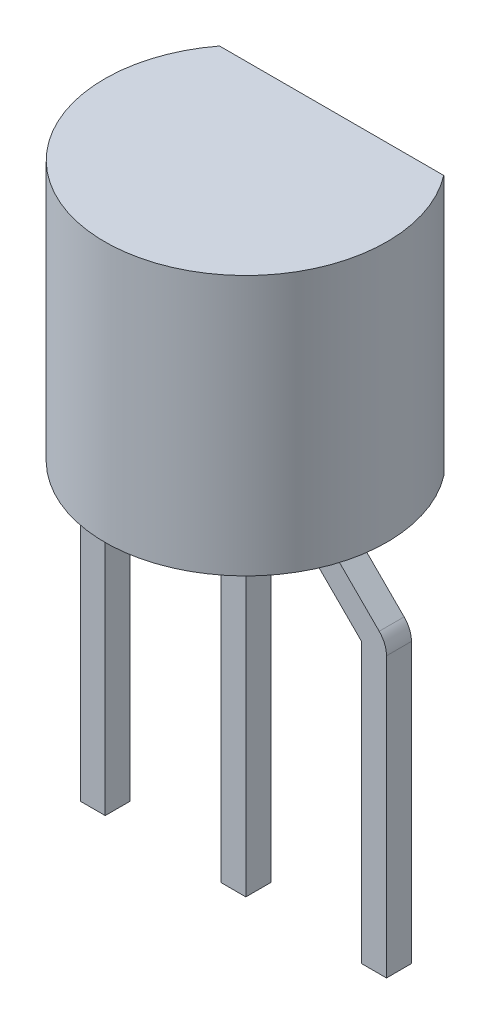
ISO-10303-21;
HEADER;
FILE_DESCRIPTION(('STEP AP214'),'2;1');
FILE_NAME('part.step','',(''),(''),'','','');
FILE_SCHEMA(('AUTOMOTIVE_DESIGN { 1 0 10303 214 1 1 1 1 }'));
ENDSEC;
DATA;
#1=APPLICATION_CONTEXT('core data for automotive mechanical design processes');
#2=APPLICATION_PROTOCOL_DEFINITION('international standard','automotive_design',2000,#1);
#3=PRODUCT_CONTEXT('',#1,'mechanical');
#4=PRODUCT('Part','Part','',(#3));
#5=PRODUCT_RELATED_PRODUCT_CATEGORY('part','',(#4));
#6=PRODUCT_DEFINITION_FORMATION('','',#4);
#7=PRODUCT_DEFINITION_CONTEXT('part definition',#1,'design');
#8=PRODUCT_DEFINITION('design','',#6,#7);
#9=PRODUCT_DEFINITION_SHAPE('','',#8);
#10=(LENGTH_UNIT() NAMED_UNIT(*) SI_UNIT(.MILLI.,.METRE.));
#11=(NAMED_UNIT(*) PLANE_ANGLE_UNIT() SI_UNIT($,.RADIAN.));
#12=(NAMED_UNIT(*) SI_UNIT($,.STERADIAN.) SOLID_ANGLE_UNIT());
#13=UNCERTAINTY_MEASURE_WITH_UNIT(LENGTH_MEASURE(1.E-05),#10,'distance_accuracy_value','');
#14=(GEOMETRIC_REPRESENTATION_CONTEXT(3) GLOBAL_UNCERTAINTY_ASSIGNED_CONTEXT((#13)) GLOBAL_UNIT_ASSIGNED_CONTEXT((#10,
#11,#12)) REPRESENTATION_CONTEXT('',''));
#15=CARTESIAN_POINT('',(0.,0.,0.));
#16=DIRECTION('',(0.,0.,1.));
#17=DIRECTION('',(1.,0.,0.));
#18=AXIS2_PLACEMENT_3D('',#15,#16,#17);
#19=CARTESIAN_POINT('',(-1.495,-0.1,0.225));
#20=DIRECTION('',(0.,0.,-1.));
#21=DIRECTION('',(-1.,0.,0.));
#22=AXIS2_PLACEMENT_3D('',#19,#20,#21);
#23=PLANE('',#22);
#24=DIRECTION('',(0.,1.,0.));
#25=VECTOR('',#24,1.);
#26=CARTESIAN_POINT('',(-1.495,-0.1,0.225));
#27=LINE('',#26,#25);
#28=CARTESIAN_POINT('',(-1.495,-0.1,0.225));
#29=VERTEX_POINT('',#28);
#30=CARTESIAN_POINT('',(-1.495,0.,0.225));
#31=VERTEX_POINT('',#30);
#32=EDGE_CURVE('E126',#29,#31,#27,.T.);
#33=ORIENTED_EDGE('',*,*,#32,.F.);
#34=DIRECTION('',(0.707106781186549,0.707106781186546,0.));
#35=VECTOR('',#34,1.);
#36=CARTESIAN_POINT('',(-2.63344191771034,-1.23844191771034,0.225));
#37=LINE('',#36,#35);
#38=CARTESIAN_POINT('',(-2.63344191771034,-1.23844191771034,0.225));
#39=VERTEX_POINT('',#38);
#40=EDGE_CURVE('E209',#29,#39,#37,.F.);
#41=ORIENTED_EDGE('',*,*,#40,.T.);
#42=CARTESIAN_POINT('',(-2.3152438661764,-1.55663996924429,0.225));
#43=DIRECTION('',(0.,0.,-1.));
#44=DIRECTION('',(-1.,0.,0.));
#45=AXIS2_PLACEMENT_3D('',#42,#43,#44);
#46=CIRCLE('',#45,0.45);
#47=CARTESIAN_POINT('',(-2.7652438661764,-1.55663996924429,0.225));
#48=VERTEX_POINT('',#47);
#49=EDGE_CURVE('E207',#48,#39,#46,.T.);
#50=ORIENTED_EDGE('',*,*,#49,.F.);
#51=DIRECTION('',(0.,1.,0.));
#52=VECTOR('',#51,1.);
#53=CARTESIAN_POINT('',(-2.7652438661764,-6.59663996924429,0.225));
#54=LINE('',#53,#52);
#55=CARTESIAN_POINT('',(-2.7652438661764,-6.59663996924429,0.225));
#56=VERTEX_POINT('',#55);
#57=EDGE_CURVE('E151',#48,#56,#54,.F.);
#58=ORIENTED_EDGE('',*,*,#57,.T.);
#59=DIRECTION('',(1.,0.,0.));
#60=VECTOR('',#59,1.);
#61=CARTESIAN_POINT('',(-2.7652438661764,-6.59663996924429,0.225));
#62=LINE('',#61,#60);
#63=CARTESIAN_POINT('',(-2.3152438661764,-6.59663996924429,0.225));
#64=VERTEX_POINT('',#63);
#65=EDGE_CURVE('E144',#64,#56,#62,.F.);
#66=ORIENTED_EDGE('',*,*,#65,.F.);
#67=DIRECTION('',(0.,-1.,0.));
#68=VECTOR('',#67,1.);
#69=CARTESIAN_POINT('',(-2.3152438661764,-6.59663996924429,0.225));
#70=LINE('',#69,#68);
#71=CARTESIAN_POINT('',(-2.3152438661764,-1.55663996924429,0.225));
#72=VERTEX_POINT('',#71);
#73=EDGE_CURVE('E246',#64,#72,#70,.F.);
#74=ORIENTED_EDGE('',*,*,#73,.T.);
#75=DIRECTION('',(-0.707106781186549,-0.707106781186546,0.));
#76=VECTOR('',#75,1.);
#77=CARTESIAN_POINT('',(-1.17680194846605,-0.418198051533947,0.225));
#78=LINE('',#77,#76);
#79=CARTESIAN_POINT('',(-1.17680194846605,-0.418198051533947,0.225));
#80=VERTEX_POINT('',#79);
#81=EDGE_CURVE('E137',#80,#72,#78,.T.);
#82=ORIENTED_EDGE('',*,*,#81,.F.);
#83=CARTESIAN_POINT('',(-1.495,-0.1,0.225));
#84=DIRECTION('',(0.,0.,1.));
#85=DIRECTION('',(1.,0.,0.));
#86=AXIS2_PLACEMENT_3D('',#83,#84,#85);
#87=CIRCLE('',#86,0.45);
#88=CARTESIAN_POINT('',(-1.045,-0.1,0.225));
#89=VERTEX_POINT('',#88);
#90=EDGE_CURVE('E18',#89,#80,#87,.F.);
#91=ORIENTED_EDGE('',*,*,#90,.F.);
#92=DIRECTION('',(0.,1.,0.));
#93=VECTOR('',#92,1.);
#94=CARTESIAN_POINT('',(-1.045,-0.1,0.225));
#95=LINE('',#94,#93);
#96=CARTESIAN_POINT('',(-1.045,0.,0.225));
#97=VERTEX_POINT('',#96);
#98=EDGE_CURVE('E107',#97,#89,#95,.F.);
#99=ORIENTED_EDGE('',*,*,#98,.F.);
#100=DIRECTION('',(-1.,0.,0.));
#101=VECTOR('',#100,1.);
#102=CARTESIAN_POINT('',(-1.495,0.,0.225));
#103=LINE('',#102,#101);
#104=EDGE_CURVE('E116',#31,#97,#103,.F.);
#105=ORIENTED_EDGE('',*,*,#104,.F.);
#106=EDGE_LOOP('',(#33,#41,#50,#58,#66,#74,#82,#91,#99,#105));
#107=FACE_BOUND('',#106,.T.);
#108=ADVANCED_FACE('F15',(#107),#23,.F.);
#109=CARTESIAN_POINT('',(1.045,-0.1,0.225));
#110=DIRECTION('',(0.,0.,-1.));
#111=DIRECTION('',(-1.,0.,0.));
#112=AXIS2_PLACEMENT_3D('',#109,#110,#111);
#113=PLANE('',#112);
#114=DIRECTION('',(0.,1.,0.));
#115=VECTOR('',#114,1.);
#116=CARTESIAN_POINT('',(1.045,-0.1,0.225));
#117=LINE('',#116,#115);
#118=CARTESIAN_POINT('',(1.045,-0.1,0.225));
#119=VERTEX_POINT('',#118);
#120=CARTESIAN_POINT('',(1.045,0.,0.225));
#121=VERTEX_POINT('',#120);
#122=EDGE_CURVE('E166',#119,#121,#117,.T.);
#123=ORIENTED_EDGE('',*,*,#122,.F.);
#124=CARTESIAN_POINT('',(1.495,-0.1,0.225));
#125=DIRECTION('',(0.,0.,-1.));
#126=DIRECTION('',(-1.,0.,0.));
#127=AXIS2_PLACEMENT_3D('',#124,#125,#126);
#128=CIRCLE('',#127,0.45);
#129=CARTESIAN_POINT('',(1.17680194846605,-0.418198051533947,0.225));
#130=VERTEX_POINT('',#129);
#131=EDGE_CURVE('E202',#130,#119,#128,.T.);
#132=ORIENTED_EDGE('',*,*,#131,.F.);
#133=DIRECTION('',(-0.707106781186549,0.707106781186546,0.));
#134=VECTOR('',#133,1.);
#135=CARTESIAN_POINT('',(2.3152438661764,-1.55663996924429,0.225));
#136=LINE('',#135,#134);
#137=CARTESIAN_POINT('',(2.3152438661764,-1.55663996924429,0.225));
#138=VERTEX_POINT('',#137);
#139=EDGE_CURVE('E205',#130,#138,#136,.F.);
#140=ORIENTED_EDGE('',*,*,#139,.T.);
#141=DIRECTION('',(0.,1.,0.));
#142=VECTOR('',#141,1.);
#143=CARTESIAN_POINT('',(2.3152438661764,-6.59663996924429,0.225));
#144=LINE('',#143,#142);
#145=CARTESIAN_POINT('',(2.3152438661764,-6.59663996924429,0.225));
#146=VERTEX_POINT('',#145);
#147=EDGE_CURVE('E235',#138,#146,#144,.F.);
#148=ORIENTED_EDGE('',*,*,#147,.T.);
#149=DIRECTION('',(1.,0.,0.));
#150=VECTOR('',#149,1.);
#151=CARTESIAN_POINT('',(2.3152438661764,-6.59663996924429,0.225));
#152=LINE('',#151,#150);
#153=CARTESIAN_POINT('',(2.7652438661764,-6.59663996924429,0.225));
#154=VERTEX_POINT('',#153);
#155=EDGE_CURVE('E228',#154,#146,#152,.F.);
#156=ORIENTED_EDGE('',*,*,#155,.F.);
#157=DIRECTION('',(0.,-1.,0.));
#158=VECTOR('',#157,1.);
#159=CARTESIAN_POINT('',(2.7652438661764,-6.59663996924429,0.225));
#160=LINE('',#159,#158);
#161=CARTESIAN_POINT('',(2.7652438661764,-1.55663996924429,0.225));
#162=VERTEX_POINT('',#161);
#163=EDGE_CURVE('E314',#154,#162,#160,.F.);
#164=ORIENTED_EDGE('',*,*,#163,.T.);
#165=CARTESIAN_POINT('',(2.3152438661764,-1.55663996924429,0.225));
#166=DIRECTION('',(0.,0.,1.));
#167=DIRECTION('',(1.,0.,0.));
#168=AXIS2_PLACEMENT_3D('',#165,#166,#167);
#169=CIRCLE('',#168,0.45);
#170=CARTESIAN_POINT('',(2.63344191771034,-1.23844191771034,0.225));
#171=VERTEX_POINT('',#170);
#172=EDGE_CURVE('E210',#171,#162,#169,.F.);
#173=ORIENTED_EDGE('',*,*,#172,.F.);
#174=DIRECTION('',(0.707106781186549,-0.707106781186546,0.));
#175=VECTOR('',#174,1.);
#176=CARTESIAN_POINT('',(1.495,-0.1,0.225));
#177=LINE('',#176,#175);
#178=CARTESIAN_POINT('',(1.495,-0.1,0.225));
#179=VERTEX_POINT('',#178);
#180=EDGE_CURVE('E171',#179,#171,#177,.T.);
#181=ORIENTED_EDGE('',*,*,#180,.F.);
#182=DIRECTION('',(0.,1.,0.));
#183=VECTOR('',#182,1.);
#184=CARTESIAN_POINT('',(1.495,-0.1,0.225));
#185=LINE('',#184,#183);
#186=CARTESIAN_POINT('',(1.495,0.,0.225));
#187=VERTEX_POINT('',#186);
#188=EDGE_CURVE('E125',#187,#179,#185,.F.);
#189=ORIENTED_EDGE('',*,*,#188,.F.);
#190=DIRECTION('',(-1.,0.,0.));
#191=VECTOR('',#190,1.);
#192=CARTESIAN_POINT('',(1.045,0.,0.225));
#193=LINE('',#192,#191);
#194=EDGE_CURVE('E162',#121,#187,#193,.F.);
#195=ORIENTED_EDGE('',*,*,#194,.F.);
#196=EDGE_LOOP('',(#123,#132,#140,#148,#156,#164,#173,#181,#189,#195));
#197=FACE_BOUND('',#196,.T.);
#198=ADVANCED_FACE('F526',(#197),#113,.F.);
#199=CARTESIAN_POINT('',(-0.225,-1.59863016228097,0.225));
#200=DIRECTION('',(1.,0.,0.));
#201=DIRECTION('',(0.,0.,-1.));
#202=AXIS2_PLACEMENT_3D('',#199,#200,#201);
#203=PLANE('',#202);
#204=DIRECTION('',(0.,1.,0.));
#205=VECTOR('',#204,1.);
#206=CARTESIAN_POINT('',(-0.225,-1.59863016228097,-0.225));
#207=LINE('',#206,#205);
#208=CARTESIAN_POINT('',(-0.225,0.,-0.225));
#209=VERTEX_POINT('',#208);
#210=CARTESIAN_POINT('',(-0.225,-6.59863016228097,-0.225));
#211=VERTEX_POINT('',#210);
#212=EDGE_CURVE('E452',#209,#211,#207,.F.);
#213=ORIENTED_EDGE('',*,*,#212,.T.);
#214=DIRECTION('',(0.,0.,-1.));
#215=VECTOR('',#214,1.);
#216=CARTESIAN_POINT('',(-0.225,-6.59863016228097,-0.225));
#217=LINE('',#216,#215);
#218=CARTESIAN_POINT('',(-0.225,-6.59863016228097,0.225));
#219=VERTEX_POINT('',#218);
#220=EDGE_CURVE('E454',#219,#211,#217,.T.);
#221=ORIENTED_EDGE('',*,*,#220,.F.);
#222=DIRECTION('',(0.,1.,0.));
#223=VECTOR('',#222,1.);
#224=CARTESIAN_POINT('',(-0.225,-1.59863016228097,0.225));
#225=LINE('',#224,#223);
#226=CARTESIAN_POINT('',(-0.225,0.,0.225));
#227=VERTEX_POINT('',#226);
#228=EDGE_CURVE('E501',#219,#227,#225,.T.);
#229=ORIENTED_EDGE('',*,*,#228,.T.);
#230=DIRECTION('',(0.,0.,-1.));
#231=VECTOR('',#230,1.);
#232=CARTESIAN_POINT('',(-0.225,0.,0.225));
#233=LINE('',#232,#231);
#234=EDGE_CURVE('E165',#209,#227,#233,.F.);
#235=ORIENTED_EDGE('',*,*,#234,.F.);
#236=EDGE_LOOP('',(#213,#221,#229,#235));
#237=FACE_BOUND('',#236,.T.);
#238=ADVANCED_FACE('F792',(#237),#203,.F.);
#239=CARTESIAN_POINT('',(-2.63344191771034,-1.23844191771034,-0.225));
#240=DIRECTION('',(0.707106781186546,-0.707106781186549,0.));
#241=DIRECTION('',(0.707106781186549,0.707106781186546,0.));
#242=AXIS2_PLACEMENT_3D('',#239,#240,#241);
#243=PLANE('',#242);
#244=DIRECTION('',(-0.707106781186549,-0.707106781186546,0.));
#245=VECTOR('',#244,1.);
#246=CARTESIAN_POINT('',(-1.495,-0.1,-0.225));
#247=LINE('',#246,#245);
#248=CARTESIAN_POINT('',(-1.495,-0.1,-0.225));
#249=VERTEX_POINT('',#248);
#250=CARTESIAN_POINT('',(-2.63344191771034,-1.23844191771034,-0.225));
#251=VERTEX_POINT('',#250);
#252=EDGE_CURVE('E201',#249,#251,#247,.T.);
#253=ORIENTED_EDGE('',*,*,#252,.T.);
#254=DIRECTION('',(0.,0.,-1.));
#255=VECTOR('',#254,1.);
#256=CARTESIAN_POINT('',(-2.63344191771034,-1.23844191771034,-0.225));
#257=LINE('',#256,#255);
#258=EDGE_CURVE('E155',#39,#251,#257,.T.);
#259=ORIENTED_EDGE('',*,*,#258,.F.);
#260=ORIENTED_EDGE('',*,*,#40,.F.);
#261=DIRECTION('',(0.,0.,-1.));
#262=VECTOR('',#261,1.);
#263=CARTESIAN_POINT('',(-1.495,-0.1,0.225));
#264=LINE('',#263,#262);
#265=EDGE_CURVE('E297',#29,#249,#264,.T.);
#266=ORIENTED_EDGE('',*,*,#265,.T.);
#267=EDGE_LOOP('',(#253,#259,#260,#266));
#268=FACE_BOUND('',#267,.T.);
#269=ADVANCED_FACE('F783',(#268),#243,.F.);
#270=CARTESIAN_POINT('',(-2.3152438661764,-1.55663996924429,-0.225));
#271=DIRECTION('',(0.,0.,-1.));
#272=DIRECTION('',(-1.,0.,0.));
#273=AXIS2_PLACEMENT_3D('',#270,#271,#272);
#274=CYLINDRICAL_SURFACE('',#273,0.45);
#275=ORIENTED_EDGE('',*,*,#258,.T.);
#276=CARTESIAN_POINT('',(-2.3152438661764,-1.55663996924429,-0.225));
#277=DIRECTION('',(0.,0.,-1.));
#278=DIRECTION('',(-1.,0.,0.));
#279=AXIS2_PLACEMENT_3D('',#276,#277,#278);
#280=CIRCLE('',#279,0.45);
#281=CARTESIAN_POINT('',(-2.7652438661764,-1.55663996924429,-0.225));
#282=VERTEX_POINT('',#281);
#283=EDGE_CURVE('E198',#251,#282,#280,.F.);
#284=ORIENTED_EDGE('',*,*,#283,.T.);
#285=DIRECTION('',(0.,0.,1.));
#286=VECTOR('',#285,1.);
#287=CARTESIAN_POINT('',(-2.7652438661764,-1.55663996924429,0.225));
#288=LINE('',#287,#286);
#289=EDGE_CURVE('E154',#282,#48,#288,.T.);
#290=ORIENTED_EDGE('',*,*,#289,.T.);
#291=ORIENTED_EDGE('',*,*,#49,.T.);
#292=EDGE_LOOP('',(#275,#284,#290,#291));
#293=FACE_BOUND('',#292,.T.);
#294=ADVANCED_FACE('F774',(#293),#274,.T.);
#295=CARTESIAN_POINT('',(-2.7652438661764,-6.59663996924429,0.225));
#296=DIRECTION('',(1.,0.,0.));
#297=DIRECTION('',(0.,1.,0.));
#298=AXIS2_PLACEMENT_3D('',#295,#296,#297);
#299=PLANE('',#298);
#300=DIRECTION('',(0.,1.,0.));
#301=VECTOR('',#300,1.);
#302=CARTESIAN_POINT('',(-2.7652438661764,-0.1,-0.225));
#303=LINE('',#302,#301);
#304=CARTESIAN_POINT('',(-2.7652438661764,-6.59663996924429,-0.225));
#305=VERTEX_POINT('',#304);
#306=EDGE_CURVE('E200',#282,#305,#303,.F.);
#307=ORIENTED_EDGE('',*,*,#306,.T.);
#308=DIRECTION('',(0.,0.,1.));
#309=VECTOR('',#308,1.);
#310=CARTESIAN_POINT('',(-2.7652438661764,-6.59663996924429,-0.225));
#311=LINE('',#310,#309);
#312=EDGE_CURVE('E148',#56,#305,#311,.F.);
#313=ORIENTED_EDGE('',*,*,#312,.F.);
#314=ORIENTED_EDGE('',*,*,#57,.F.);
#315=ORIENTED_EDGE('',*,*,#289,.F.);
#316=EDGE_LOOP('',(#307,#313,#314,#315));
#317=FACE_BOUND('',#316,.T.);
#318=ADVANCED_FACE('F765',(#317),#299,.F.);
#319=CARTESIAN_POINT('',(-2.7652438661764,-6.59663996924429,-0.225));
#320=DIRECTION('',(0.,-1.,0.));
#321=DIRECTION('',(1.,0.,0.));
#322=AXIS2_PLACEMENT_3D('',#319,#320,#321);
#323=PLANE('',#322);
#324=DIRECTION('',(0.,0.,1.));
#325=VECTOR('',#324,1.);
#326=CARTESIAN_POINT('',(-2.3152438661764,-6.59663996924429,0.225));
#327=LINE('',#326,#325);
#328=CARTESIAN_POINT('',(-2.3152438661764,-6.59663996924429,-0.225));
#329=VERTEX_POINT('',#328);
#330=EDGE_CURVE('E147',#329,#64,#327,.T.);
#331=ORIENTED_EDGE('',*,*,#330,.T.);
#332=ORIENTED_EDGE('',*,*,#65,.T.);
#333=ORIENTED_EDGE('',*,*,#312,.T.);
#334=DIRECTION('',(1.,0.,0.));
#335=VECTOR('',#334,1.);
#336=CARTESIAN_POINT('',(-1.495,-6.59663996924429,-0.225));
#337=LINE('',#336,#335);
#338=EDGE_CURVE('E276',#305,#329,#337,.T.);
#339=ORIENTED_EDGE('',*,*,#338,.T.);
#340=EDGE_LOOP('',(#331,#332,#333,#339));
#341=FACE_BOUND('',#340,.T.);
#342=ADVANCED_FACE('F757',(#341),#323,.T.);
#343=CARTESIAN_POINT('',(-2.3152438661764,-6.59663996924429,0.225));
#344=DIRECTION('',(-1.,0.,0.));
#345=DIRECTION('',(0.,-1.,0.));
#346=AXIS2_PLACEMENT_3D('',#343,#344,#345);
#347=PLANE('',#346);
#348=ORIENTED_EDGE('',*,*,#73,.F.);
#349=ORIENTED_EDGE('',*,*,#330,.F.);
#350=DIRECTION('',(0.,1.,0.));
#351=VECTOR('',#350,1.);
#352=CARTESIAN_POINT('',(-2.3152438661764,-0.1,-0.225));
#353=LINE('',#352,#351);
#354=CARTESIAN_POINT('',(-2.3152438661764,-1.55663996924429,-0.225));
#355=VERTEX_POINT('',#354);
#356=EDGE_CURVE('E268',#329,#355,#353,.T.);
#357=ORIENTED_EDGE('',*,*,#356,.T.);
#358=DIRECTION('',(0.,0.,1.));
#359=VECTOR('',#358,1.);
#360=CARTESIAN_POINT('',(-2.3152438661764,-1.55663996924429,-0.225));
#361=LINE('',#360,#359);
#362=EDGE_CURVE('E249',#355,#72,#361,.T.);
#363=ORIENTED_EDGE('',*,*,#362,.T.);
#364=EDGE_LOOP('',(#348,#349,#357,#363));
#365=FACE_BOUND('',#364,.T.);
#366=ADVANCED_FACE('F266',(#365),#347,.F.);
#367=CARTESIAN_POINT('',(-2.3152438661764,-1.55663996924429,-0.225));
#368=DIRECTION('',(-0.707106781186546,0.707106781186549,0.));
#369=DIRECTION('',(-0.707106781186549,-0.707106781186546,0.));
#370=AXIS2_PLACEMENT_3D('',#367,#368,#369);
#371=PLANE('',#370);
#372=ORIENTED_EDGE('',*,*,#81,.T.);
#373=ORIENTED_EDGE('',*,*,#362,.F.);
#374=DIRECTION('',(0.707106781186549,0.707106781186546,0.));
#375=VECTOR('',#374,1.);
#376=CARTESIAN_POINT('',(-2.3152438661764,-1.55663996924429,-0.225));
#377=LINE('',#376,#375);
#378=CARTESIAN_POINT('',(-1.17680194846605,-0.418198051533947,-0.225));
#379=VERTEX_POINT('',#378);
#380=EDGE_CURVE('E197',#355,#379,#377,.T.);
#381=ORIENTED_EDGE('',*,*,#380,.T.);
#382=DIRECTION('',(0.,0.,1.));
#383=VECTOR('',#382,1.);
#384=CARTESIAN_POINT('',(-1.17680194846605,-0.418198051533947,0.225));
#385=LINE('',#384,#383);
#386=EDGE_CURVE('E206',#80,#379,#385,.F.);
#387=ORIENTED_EDGE('',*,*,#386,.F.);
#388=EDGE_LOOP('',(#372,#373,#381,#387));
#389=FACE_BOUND('',#388,.T.);
#390=ADVANCED_FACE('F255',(#389),#371,.F.);
#391=CARTESIAN_POINT('',(-1.495,-0.1,0.225));
#392=DIRECTION('',(0.,0.,1.));
#393=DIRECTION('',(1.,0.,0.));
#394=AXIS2_PLACEMENT_3D('',#391,#392,#393);
#395=CYLINDRICAL_SURFACE('',#394,0.45);
#396=CARTESIAN_POINT('',(-1.495,-0.1,-0.225));
#397=DIRECTION('',(0.,0.,1.));
#398=DIRECTION('',(1.,0.,0.));
#399=AXIS2_PLACEMENT_3D('',#396,#397,#398);
#400=CIRCLE('',#399,0.45);
#401=CARTESIAN_POINT('',(-1.045,-0.1,-0.225));
#402=VERTEX_POINT('',#401);
#403=EDGE_CURVE('E195',#379,#402,#400,.T.);
#404=ORIENTED_EDGE('',*,*,#403,.T.);
#405=DIRECTION('',(0.,0.,1.));
#406=VECTOR('',#405,1.);
#407=CARTESIAN_POINT('',(-1.045,-0.1,0.225));
#408=LINE('',#407,#406);
#409=EDGE_CURVE('E354',#402,#89,#408,.T.);
#410=ORIENTED_EDGE('',*,*,#409,.T.);
#411=ORIENTED_EDGE('',*,*,#90,.T.);
#412=ORIENTED_EDGE('',*,*,#386,.T.);
#413=EDGE_LOOP('',(#404,#410,#411,#412));
#414=FACE_BOUND('',#413,.T.);
#415=ADVANCED_FACE('F733',(#414),#395,.T.);
#416=CARTESIAN_POINT('',(1.495,-0.1,0.225));
#417=DIRECTION('',(0.,0.,-1.));
#418=DIRECTION('',(-1.,0.,0.));
#419=AXIS2_PLACEMENT_3D('',#416,#417,#418);
#420=CYLINDRICAL_SURFACE('',#419,0.45);
#421=ORIENTED_EDGE('',*,*,#131,.T.);
#422=DIRECTION('',(0.,0.,-1.));
#423=VECTOR('',#422,1.);
#424=CARTESIAN_POINT('',(1.045,-0.1,0.225));
#425=LINE('',#424,#423);
#426=CARTESIAN_POINT('',(1.045,-0.1,-0.225));
#427=VERTEX_POINT('',#426);
#428=EDGE_CURVE('E352',#119,#427,#425,.T.);
#429=ORIENTED_EDGE('',*,*,#428,.T.);
#430=CARTESIAN_POINT('',(1.495,-0.1,-0.225));
#431=DIRECTION('',(0.,0.,-1.));
#432=DIRECTION('',(-1.,0.,0.));
#433=AXIS2_PLACEMENT_3D('',#430,#431,#432);
#434=CIRCLE('',#433,0.45);
#435=CARTESIAN_POINT('',(1.17680194846605,-0.418198051533947,-0.225));
#436=VERTEX_POINT('',#435);
#437=EDGE_CURVE('E191',#427,#436,#434,.F.);
#438=ORIENTED_EDGE('',*,*,#437,.T.);
#439=DIRECTION('',(0.,0.,1.));
#440=VECTOR('',#439,1.);
#441=CARTESIAN_POINT('',(1.17680194846605,-0.418198051533947,0.225));
#442=LINE('',#441,#440);
#443=EDGE_CURVE('E239',#436,#130,#442,.T.);
#444=ORIENTED_EDGE('',*,*,#443,.T.);
#445=EDGE_LOOP('',(#421,#429,#438,#444));
#446=FACE_BOUND('',#445,.T.);
#447=ADVANCED_FACE('F724',(#446),#420,.T.);
#448=CARTESIAN_POINT('',(2.3152438661764,-1.55663996924429,0.225));
#449=DIRECTION('',(0.707106781186546,0.707106781186549,0.));
#450=DIRECTION('',(-0.707106781186549,0.707106781186546,0.));
#451=AXIS2_PLACEMENT_3D('',#448,#449,#450);
#452=PLANE('',#451);
#453=DIRECTION('',(0.707106781186549,-0.707106781186546,0.));
#454=VECTOR('',#453,1.);
#455=CARTESIAN_POINT('',(1.17680194846605,-0.418198051533947,-0.225));
#456=LINE('',#455,#454);
#457=CARTESIAN_POINT('',(2.3152438661764,-1.55663996924429,-0.225));
#458=VERTEX_POINT('',#457);
#459=EDGE_CURVE('E193',#436,#458,#456,.T.);
#460=ORIENTED_EDGE('',*,*,#459,.T.);
#461=DIRECTION('',(0.,0.,1.));
#462=VECTOR('',#461,1.);
#463=CARTESIAN_POINT('',(2.3152438661764,-1.55663996924429,0.225));
#464=LINE('',#463,#462);
#465=EDGE_CURVE('E238',#458,#138,#464,.T.);
#466=ORIENTED_EDGE('',*,*,#465,.T.);
#467=ORIENTED_EDGE('',*,*,#139,.F.);
#468=ORIENTED_EDGE('',*,*,#443,.F.);
#469=EDGE_LOOP('',(#460,#466,#467,#468));
#470=FACE_BOUND('',#469,.T.);
#471=ADVANCED_FACE('F715',(#470),#452,.F.);
#472=CARTESIAN_POINT('',(2.3152438661764,-6.59663996924429,0.225));
#473=DIRECTION('',(1.,0.,0.));
#474=DIRECTION('',(0.,1.,0.));
#475=AXIS2_PLACEMENT_3D('',#472,#473,#474);
#476=PLANE('',#475);
#477=DIRECTION('',(0.,1.,0.));
#478=VECTOR('',#477,1.);
#479=CARTESIAN_POINT('',(2.3152438661764,-0.1,-0.225));
#480=LINE('',#479,#478);
#481=CARTESIAN_POINT('',(2.3152438661764,-6.59663996924429,-0.225));
#482=VERTEX_POINT('',#481);
#483=EDGE_CURVE('E335',#458,#482,#480,.F.);
#484=ORIENTED_EDGE('',*,*,#483,.T.);
#485=DIRECTION('',(0.,0.,1.));
#486=VECTOR('',#485,1.);
#487=CARTESIAN_POINT('',(2.3152438661764,-6.59663996924429,-0.225000000000001));
#488=LINE('',#487,#486);
#489=EDGE_CURVE('E232',#146,#482,#488,.F.);
#490=ORIENTED_EDGE('',*,*,#489,.F.);
#491=ORIENTED_EDGE('',*,*,#147,.F.);
#492=ORIENTED_EDGE('',*,*,#465,.F.);
#493=EDGE_LOOP('',(#484,#490,#491,#492));
#494=FACE_BOUND('',#493,.T.);
#495=ADVANCED_FACE('F543',(#494),#476,.F.);
#496=CARTESIAN_POINT('',(2.3152438661764,-6.59663996924429,-0.225000000000001));
#497=DIRECTION('',(0.,-1.,0.));
#498=DIRECTION('',(1.,0.,0.));
#499=AXIS2_PLACEMENT_3D('',#496,#497,#498);
#500=PLANE('',#499);
#501=DIRECTION('',(0.,0.,1.));
#502=VECTOR('',#501,1.);
#503=CARTESIAN_POINT('',(2.7652438661764,-6.59663996924429,0.225));
#504=LINE('',#503,#502);
#505=CARTESIAN_POINT('',(2.7652438661764,-6.59663996924429,-0.225));
#506=VERTEX_POINT('',#505);
#507=EDGE_CURVE('E231',#506,#154,#504,.T.);
#508=ORIENTED_EDGE('',*,*,#507,.T.);
#509=ORIENTED_EDGE('',*,*,#155,.T.);
#510=ORIENTED_EDGE('',*,*,#489,.T.);
#511=DIRECTION('',(1.,0.,0.));
#512=VECTOR('',#511,1.);
#513=CARTESIAN_POINT('',(1.045,-6.59663996924429,-0.225));
#514=LINE('',#513,#512);
#515=EDGE_CURVE('E333',#482,#506,#514,.T.);
#516=ORIENTED_EDGE('',*,*,#515,.T.);
#517=EDGE_LOOP('',(#508,#509,#510,#516));
#518=FACE_BOUND('',#517,.T.);
#519=ADVANCED_FACE('F535',(#518),#500,.T.);
#520=CARTESIAN_POINT('',(2.7652438661764,-6.59663996924429,0.225));
#521=DIRECTION('',(-1.,0.,0.));
#522=DIRECTION('',(0.,-1.,0.));
#523=AXIS2_PLACEMENT_3D('',#520,#521,#522);
#524=PLANE('',#523);
#525=ORIENTED_EDGE('',*,*,#163,.F.);
#526=ORIENTED_EDGE('',*,*,#507,.F.);
#527=DIRECTION('',(0.,1.,0.));
#528=VECTOR('',#527,1.);
#529=CARTESIAN_POINT('',(2.7652438661764,-0.1,-0.225));
#530=LINE('',#529,#528);
#531=CARTESIAN_POINT('',(2.7652438661764,-1.55663996924429,-0.225));
#532=VERTEX_POINT('',#531);
#533=EDGE_CURVE('E190',#506,#532,#530,.T.);
#534=ORIENTED_EDGE('',*,*,#533,.T.);
#535=DIRECTION('',(0.,0.,1.));
#536=VECTOR('',#535,1.);
#537=CARTESIAN_POINT('',(2.7652438661764,-1.55663996924429,0.225));
#538=LINE('',#537,#536);
#539=EDGE_CURVE('E316',#162,#532,#538,.F.);
#540=ORIENTED_EDGE('',*,*,#539,.F.);
#541=EDGE_LOOP('',(#525,#526,#534,#540));
#542=FACE_BOUND('',#541,.T.);
#543=ADVANCED_FACE('F533',(#542),#524,.F.);
#544=CARTESIAN_POINT('',(2.3152438661764,-1.55663996924429,0.225));
#545=DIRECTION('',(0.,0.,1.));
#546=DIRECTION('',(1.,0.,0.));
#547=AXIS2_PLACEMENT_3D('',#544,#545,#546);
#548=CYLINDRICAL_SURFACE('',#547,0.45);
#549=DIRECTION('',(0.,0.,1.));
#550=VECTOR('',#549,1.);
#551=CARTESIAN_POINT('',(2.63344191771034,-1.23844191771034,0.225));
#552=LINE('',#551,#550);
#553=CARTESIAN_POINT('',(2.63344191771034,-1.23844191771034,-0.225));
#554=VERTEX_POINT('',#553);
#555=EDGE_CURVE('E322',#554,#171,#552,.T.);
#556=ORIENTED_EDGE('',*,*,#555,.T.);
#557=ORIENTED_EDGE('',*,*,#172,.T.);
#558=ORIENTED_EDGE('',*,*,#539,.T.);
#559=CARTESIAN_POINT('',(2.3152438661764,-1.55663996924429,-0.225));
#560=DIRECTION('',(0.,0.,1.));
#561=DIRECTION('',(1.,0.,0.));
#562=AXIS2_PLACEMENT_3D('',#559,#560,#561);
#563=CIRCLE('',#562,0.45);
#564=EDGE_CURVE('E187',#532,#554,#563,.T.);
#565=ORIENTED_EDGE('',*,*,#564,.T.);
#566=EDGE_LOOP('',(#556,#557,#558,#565));
#567=FACE_BOUND('',#566,.T.);
#568=ADVANCED_FACE('F528',(#567),#548,.T.);
#569=CARTESIAN_POINT('',(2.63344191771034,-1.23844191771034,0.225));
#570=DIRECTION('',(-0.707106781186546,-0.707106781186549,0.));
#571=DIRECTION('',(0.707106781186549,-0.707106781186546,0.));
#572=AXIS2_PLACEMENT_3D('',#569,#570,#571);
#573=PLANE('',#572);
#574=ORIENTED_EDGE('',*,*,#180,.T.);
#575=ORIENTED_EDGE('',*,*,#555,.F.);
#576=DIRECTION('',(-0.707106781186549,0.707106781186546,0.));
#577=VECTOR('',#576,1.);
#578=CARTESIAN_POINT('',(2.63344191771034,-1.23844191771034,-0.225));
#579=LINE('',#578,#577);
#580=CARTESIAN_POINT('',(1.495,-0.0999999999999999,-0.225));
#581=VERTEX_POINT('',#580);
#582=EDGE_CURVE('E189',#554,#581,#579,.T.);
#583=ORIENTED_EDGE('',*,*,#582,.T.);
#584=DIRECTION('',(0.,0.,1.));
#585=VECTOR('',#584,1.);
#586=CARTESIAN_POINT('',(1.495,-0.1,0.225));
#587=LINE('',#586,#585);
#588=EDGE_CURVE('E511',#179,#581,#587,.F.);
#589=ORIENTED_EDGE('',*,*,#588,.F.);
#590=EDGE_LOOP('',(#574,#575,#583,#589));
#591=FACE_BOUND('',#590,.T.);
#592=ADVANCED_FACE('F527',(#591),#573,.F.);
#593=CARTESIAN_POINT('',(-0.225,-1.59863016228097,-0.225));
#594=DIRECTION('',(0.,0.,1.));
#595=DIRECTION('',(1.,0.,0.));
#596=AXIS2_PLACEMENT_3D('',#593,#594,#595);
#597=PLANE('',#596);
#598=DIRECTION('',(0.,1.,0.));
#599=VECTOR('',#598,1.);
#600=CARTESIAN_POINT('',(0.225,-1.59863016228097,-0.225));
#601=LINE('',#600,#599);
#602=CARTESIAN_POINT('',(0.225,0.,-0.225));
#603=VERTEX_POINT('',#602);
#604=CARTESIAN_POINT('',(0.225,-6.59863016228097,-0.225));
#605=VERTEX_POINT('',#604);
#606=EDGE_CURVE('E450',#603,#605,#601,.F.);
#607=ORIENTED_EDGE('',*,*,#606,.T.);
#608=DIRECTION('',(1.,0.,0.));
#609=VECTOR('',#608,1.);
#610=CARTESIAN_POINT('',(-0.225,-6.59863016228097,-0.225));
#611=LINE('',#610,#609);
#612=EDGE_CURVE('E506',#211,#605,#611,.T.);
#613=ORIENTED_EDGE('',*,*,#612,.F.);
#614=ORIENTED_EDGE('',*,*,#212,.F.);
#615=DIRECTION('',(1.,0.,0.));
#616=VECTOR('',#615,1.);
#617=CARTESIAN_POINT('',(-0.225,0.,-0.225));
#618=LINE('',#617,#616);
#619=EDGE_CURVE('E446',#603,#209,#618,.F.);
#620=ORIENTED_EDGE('',*,*,#619,.F.);
#621=EDGE_LOOP('',(#607,#613,#614,#620));
#622=FACE_BOUND('',#621,.T.);
#623=ADVANCED_FACE('F448',(#622),#597,.F.);
#624=CARTESIAN_POINT('',(-0.225,-6.59863016228097,-0.225));
#625=DIRECTION('',(0.,-1.,0.));
#626=DIRECTION('',(0.,0.,-1.));
#627=AXIS2_PLACEMENT_3D('',#624,#625,#626);
#628=PLANE('',#627);
#629=DIRECTION('',(0.,0.,1.));
#630=VECTOR('',#629,1.);
#631=CARTESIAN_POINT('',(0.225,-6.59863016228097,0.225));
#632=LINE('',#631,#630);
#633=CARTESIAN_POINT('',(0.225,-6.59863016228097,0.225));
#634=VERTEX_POINT('',#633);
#635=EDGE_CURVE('E461',#605,#634,#632,.T.);
#636=ORIENTED_EDGE('',*,*,#635,.T.);
#637=DIRECTION('',(-1.,0.,0.));
#638=VECTOR('',#637,1.);
#639=CARTESIAN_POINT('',(-0.225,-6.59863016228097,0.225));
#640=LINE('',#639,#638);
#641=EDGE_CURVE('E503',#634,#219,#640,.T.);
#642=ORIENTED_EDGE('',*,*,#641,.T.);
#643=ORIENTED_EDGE('',*,*,#220,.T.);
#644=ORIENTED_EDGE('',*,*,#612,.T.);
#645=EDGE_LOOP('',(#636,#642,#643,#644));
#646=FACE_BOUND('',#645,.T.);
#647=ADVANCED_FACE('F580',(#646),#628,.T.);
#648=CARTESIAN_POINT('',(-0.225,-1.59863016228097,0.225));
#649=DIRECTION('',(0.,0.,-1.));
#650=DIRECTION('',(-1.,0.,0.));
#651=AXIS2_PLACEMENT_3D('',#648,#649,#650);
#652=PLANE('',#651);
#653=ORIENTED_EDGE('',*,*,#228,.F.);
#654=ORIENTED_EDGE('',*,*,#641,.F.);
#655=DIRECTION('',(0.,1.,0.));
#656=VECTOR('',#655,1.);
#657=CARTESIAN_POINT('',(0.225,-1.59863016228097,0.225));
#658=LINE('',#657,#656);
#659=CARTESIAN_POINT('',(0.225,0.,0.225));
#660=VERTEX_POINT('',#659);
#661=EDGE_CURVE('E475',#634,#660,#658,.T.);
#662=ORIENTED_EDGE('',*,*,#661,.T.);
#663=DIRECTION('',(-1.,0.,0.));
#664=VECTOR('',#663,1.);
#665=CARTESIAN_POINT('',(-0.225,0.,0.225));
#666=LINE('',#665,#664);
#667=EDGE_CURVE('E302',#227,#660,#666,.F.);
#668=ORIENTED_EDGE('',*,*,#667,.F.);
#669=EDGE_LOOP('',(#653,#654,#662,#668));
#670=FACE_BOUND('',#669,.T.);
#671=ADVANCED_FACE('F577',(#670),#652,.F.);
#672=CARTESIAN_POINT('',(-1.495,-0.1,0.225));
#673=DIRECTION('',(1.,0.,0.));
#674=DIRECTION('',(0.,0.,-1.));
#675=AXIS2_PLACEMENT_3D('',#672,#673,#674);
#676=PLANE('',#675);
#677=DIRECTION('',(0.,1.,0.));
#678=VECTOR('',#677,1.);
#679=CARTESIAN_POINT('',(-1.495,-0.1,-0.225));
#680=LINE('',#679,#678);
#681=CARTESIAN_POINT('',(-1.495,0.,-0.225));
#682=VERTEX_POINT('',#681);
#683=EDGE_CURVE('E294',#682,#249,#680,.F.);
#684=ORIENTED_EDGE('',*,*,#683,.T.);
#685=ORIENTED_EDGE('',*,*,#265,.F.);
#686=ORIENTED_EDGE('',*,*,#32,.T.);
#687=DIRECTION('',(0.,0.,1.));
#688=VECTOR('',#687,1.);
#689=CARTESIAN_POINT('',(-1.495,0.,0.));
#690=LINE('',#689,#688);
#691=EDGE_CURVE('E122',#31,#682,#690,.F.);
#692=ORIENTED_EDGE('',*,*,#691,.T.);
#693=EDGE_LOOP('',(#684,#685,#686,#692));
#694=FACE_BOUND('',#693,.T.);
#695=ADVANCED_FACE('F574',(#694),#676,.F.);
#696=CARTESIAN_POINT('',(-1.495,-0.1,-0.225));
#697=DIRECTION('',(0.,0.,1.));
#698=DIRECTION('',(1.,0.,0.));
#699=AXIS2_PLACEMENT_3D('',#696,#697,#698);
#700=PLANE('',#699);
#701=DIRECTION('',(0.,1.,0.));
#702=VECTOR('',#701,1.);
#703=CARTESIAN_POINT('',(-1.045,-0.1,-0.225));
#704=LINE('',#703,#702);
#705=CARTESIAN_POINT('',(-1.045,0.,-0.225));
#706=VERTEX_POINT('',#705);
#707=EDGE_CURVE('E131',#706,#402,#704,.F.);
#708=ORIENTED_EDGE('',*,*,#707,.T.);
#709=ORIENTED_EDGE('',*,*,#403,.F.);
#710=ORIENTED_EDGE('',*,*,#380,.F.);
#711=ORIENTED_EDGE('',*,*,#356,.F.);
#712=ORIENTED_EDGE('',*,*,#338,.F.);
#713=ORIENTED_EDGE('',*,*,#306,.F.);
#714=ORIENTED_EDGE('',*,*,#283,.F.);
#715=ORIENTED_EDGE('',*,*,#252,.F.);
#716=ORIENTED_EDGE('',*,*,#683,.F.);
#717=DIRECTION('',(1.,0.,0.));
#718=VECTOR('',#717,1.);
#719=CARTESIAN_POINT('',(0.,0.,-0.225));
#720=LINE('',#719,#718);
#721=EDGE_CURVE('E132',#682,#706,#720,.T.);
#722=ORIENTED_EDGE('',*,*,#721,.T.);
#723=EDGE_LOOP('',(#708,#709,#710,#711,#712,#713,#714,#715,#716,#722));
#724=FACE_BOUND('',#723,.T.);
#725=ADVANCED_FACE('F374',(#724),#700,.F.);
#726=CARTESIAN_POINT('',(-1.045,-0.1,0.225));
#727=DIRECTION('',(-1.,0.,0.));
#728=DIRECTION('',(0.,0.,1.));
#729=AXIS2_PLACEMENT_3D('',#726,#727,#728);
#730=PLANE('',#729);
#731=ORIENTED_EDGE('',*,*,#98,.T.);
#732=ORIENTED_EDGE('',*,*,#409,.F.);
#733=ORIENTED_EDGE('',*,*,#707,.F.);
#734=DIRECTION('',(0.,0.,1.));
#735=VECTOR('',#734,1.);
#736=CARTESIAN_POINT('',(-1.045,0.,0.));
#737=LINE('',#736,#735);
#738=EDGE_CURVE('E120',#706,#97,#737,.T.);
#739=ORIENTED_EDGE('',*,*,#738,.T.);
#740=EDGE_LOOP('',(#731,#732,#733,#739));
#741=FACE_BOUND('',#740,.T.);
#742=ADVANCED_FACE('F129',(#741),#730,.F.);
#743=CARTESIAN_POINT('',(1.045,-0.1,0.225));
#744=DIRECTION('',(1.,0.,0.));
#745=DIRECTION('',(0.,0.,-1.));
#746=AXIS2_PLACEMENT_3D('',#743,#744,#745);
#747=PLANE('',#746);
#748=DIRECTION('',(0.,1.,0.));
#749=VECTOR('',#748,1.);
#750=CARTESIAN_POINT('',(1.045,-0.1,-0.225));
#751=LINE('',#750,#749);
#752=CARTESIAN_POINT('',(1.045,0.,-0.225));
#753=VERTEX_POINT('',#752);
#754=EDGE_CURVE('E194',#753,#427,#751,.F.);
#755=ORIENTED_EDGE('',*,*,#754,.T.);
#756=ORIENTED_EDGE('',*,*,#428,.F.);
#757=ORIENTED_EDGE('',*,*,#122,.T.);
#758=DIRECTION('',(0.,0.,1.));
#759=VECTOR('',#758,1.);
#760=CARTESIAN_POINT('',(1.045,0.,0.));
#761=LINE('',#760,#759);
#762=EDGE_CURVE('E355',#121,#753,#761,.F.);
#763=ORIENTED_EDGE('',*,*,#762,.T.);
#764=EDGE_LOOP('',(#755,#756,#757,#763));
#765=FACE_BOUND('',#764,.T.);
#766=ADVANCED_FACE('F567',(#765),#747,.F.);
#767=CARTESIAN_POINT('',(1.045,-0.1,-0.225));
#768=DIRECTION('',(0.,0.,1.));
#769=DIRECTION('',(1.,0.,0.));
#770=AXIS2_PLACEMENT_3D('',#767,#768,#769);
#771=PLANE('',#770);
#772=DIRECTION('',(0.,1.,0.));
#773=VECTOR('',#772,1.);
#774=CARTESIAN_POINT('',(1.495,-0.1,-0.225));
#775=LINE('',#774,#773);
#776=CARTESIAN_POINT('',(1.495,0.,-0.225));
#777=VERTEX_POINT('',#776);
#778=EDGE_CURVE('E462',#777,#581,#775,.F.);
#779=ORIENTED_EDGE('',*,*,#778,.T.);
#780=ORIENTED_EDGE('',*,*,#582,.F.);
#781=ORIENTED_EDGE('',*,*,#564,.F.);
#782=ORIENTED_EDGE('',*,*,#533,.F.);
#783=ORIENTED_EDGE('',*,*,#515,.F.);
#784=ORIENTED_EDGE('',*,*,#483,.F.);
#785=ORIENTED_EDGE('',*,*,#459,.F.);
#786=ORIENTED_EDGE('',*,*,#437,.F.);
#787=ORIENTED_EDGE('',*,*,#754,.F.);
#788=DIRECTION('',(1.,0.,0.));
#789=VECTOR('',#788,1.);
#790=CARTESIAN_POINT('',(0.,0.,-0.225));
#791=LINE('',#790,#789);
#792=EDGE_CURVE('E178',#753,#777,#791,.T.);
#793=ORIENTED_EDGE('',*,*,#792,.T.);
#794=EDGE_LOOP('',(#779,#780,#781,#782,#783,#784,#785,#786,#787,#793));
#795=FACE_BOUND('',#794,.T.);
#796=ADVANCED_FACE('F518',(#795),#771,.F.);
#797=CARTESIAN_POINT('',(1.495,-0.1,0.225));
#798=DIRECTION('',(-1.,0.,0.));
#799=DIRECTION('',(0.,0.,1.));
#800=AXIS2_PLACEMENT_3D('',#797,#798,#799);
#801=PLANE('',#800);
#802=ORIENTED_EDGE('',*,*,#188,.T.);
#803=ORIENTED_EDGE('',*,*,#588,.T.);
#804=ORIENTED_EDGE('',*,*,#778,.F.);
#805=DIRECTION('',(0.,0.,1.));
#806=VECTOR('',#805,1.);
#807=CARTESIAN_POINT('',(1.495,0.,0.));
#808=LINE('',#807,#806);
#809=EDGE_CURVE('E174',#777,#187,#808,.T.);
#810=ORIENTED_EDGE('',*,*,#809,.T.);
#811=EDGE_LOOP('',(#802,#803,#804,#810));
#812=FACE_BOUND('',#811,.T.);
#813=ADVANCED_FACE('F522',(#812),#801,.F.);
#814=CARTESIAN_POINT('',(0.225,-1.59863016228097,0.225));
#815=DIRECTION('',(-1.,0.,0.));
#816=DIRECTION('',(0.,0.,1.));
#817=AXIS2_PLACEMENT_3D('',#814,#815,#816);
#818=PLANE('',#817);
#819=ORIENTED_EDGE('',*,*,#661,.F.);
#820=ORIENTED_EDGE('',*,*,#635,.F.);
#821=ORIENTED_EDGE('',*,*,#606,.F.);
#822=DIRECTION('',(0.,0.,1.));
#823=VECTOR('',#822,1.);
#824=CARTESIAN_POINT('',(0.225,0.,0.));
#825=LINE('',#824,#823);
#826=EDGE_CURVE('E177',#603,#660,#825,.T.);
#827=ORIENTED_EDGE('',*,*,#826,.T.);
#828=EDGE_LOOP('',(#819,#820,#821,#827));
#829=FACE_BOUND('',#828,.T.);
#830=ADVANCED_FACE('F460',(#829),#818,.F.);
#831=CARTESIAN_POINT('',(0.,4.7,0.));
#832=DIRECTION('',(0.,1.,0.));
#833=DIRECTION('',(0.,0.,1.));
#834=AXIS2_PLACEMENT_3D('',#831,#832,#833);
#835=PLANE('',#834);
#836=CARTESIAN_POINT('',(0.,4.7,0.));
#837=DIRECTION('',(0.,-1.,0.));
#838=DIRECTION('',(0.,0.,-1.));
#839=AXIS2_PLACEMENT_3D('',#836,#837,#838);
#840=CIRCLE('',#839,2.55);
#841=CARTESIAN_POINT('',(2.02484567313166,4.7,-1.55));
#842=VERTEX_POINT('',#841);
#843=CARTESIAN_POINT('',(-2.02484567313166,4.7,-1.55));
#844=VERTEX_POINT('',#843);
#845=EDGE_CURVE('E183',#842,#844,#840,.T.);
#846=ORIENTED_EDGE('',*,*,#845,.F.);
#847=DIRECTION('',(-1.,0.,0.));
#848=VECTOR('',#847,1.);
#849=CARTESIAN_POINT('',(-5.75142135623731,4.7,-1.55));
#850=LINE('',#849,#848);
#851=EDGE_CURVE('E306',#844,#842,#850,.F.);
#852=ORIENTED_EDGE('',*,*,#851,.F.);
#853=EDGE_LOOP('',(#846,#852));
#854=FACE_BOUND('',#853,.T.);
#855=ADVANCED_FACE('F557',(#854),#835,.T.);
#856=CARTESIAN_POINT('',(-5.75142135623731,4.7,-1.55));
#857=DIRECTION('',(0.,0.,-1.));
#858=DIRECTION('',(-1.,0.,0.));
#859=AXIS2_PLACEMENT_3D('',#856,#857,#858);
#860=PLANE('',#859);
#861=ORIENTED_EDGE('',*,*,#851,.T.);
#862=DIRECTION('',(0.,-1.,0.));
#863=VECTOR('',#862,1.);
#864=CARTESIAN_POINT('',(2.02484567313166,4.7,-1.55));
#865=LINE('',#864,#863);
#866=CARTESIAN_POINT('',(2.02484567313166,0.,-1.55));
#867=VERTEX_POINT('',#866);
#868=EDGE_CURVE('E186',#867,#842,#865,.F.);
#869=ORIENTED_EDGE('',*,*,#868,.F.);
#870=DIRECTION('',(1.,0.,0.));
#871=VECTOR('',#870,1.);
#872=CARTESIAN_POINT('',(0.,0.,-1.55));
#873=LINE('',#872,#871);
#874=CARTESIAN_POINT('',(-2.02484567313166,0.,-1.55));
#875=VERTEX_POINT('',#874);
#876=EDGE_CURVE('E33',#867,#875,#873,.F.);
#877=ORIENTED_EDGE('',*,*,#876,.T.);
#878=DIRECTION('',(0.,-1.,0.));
#879=VECTOR('',#878,1.);
#880=CARTESIAN_POINT('',(-2.02484567313166,4.7,-1.55));
#881=LINE('',#880,#879);
#882=EDGE_CURVE('E24',#844,#875,#881,.T.);
#883=ORIENTED_EDGE('',*,*,#882,.F.);
#884=EDGE_LOOP('',(#861,#869,#877,#883));
#885=FACE_BOUND('',#884,.T.);
#886=ADVANCED_FACE('F552',(#885),#860,.T.);
#887=CARTESIAN_POINT('',(0.,0.,0.));
#888=DIRECTION('',(0.,1.,0.));
#889=DIRECTION('',(0.,0.,1.));
#890=AXIS2_PLACEMENT_3D('',#887,#888,#889);
#891=PLANE('',#890);
#892=ORIENTED_EDGE('',*,*,#619,.T.);
#893=ORIENTED_EDGE('',*,*,#234,.T.);
#894=ORIENTED_EDGE('',*,*,#667,.T.);
#895=ORIENTED_EDGE('',*,*,#826,.F.);
#896=EDGE_LOOP('',(#892,#893,#894,#895));
#897=FACE_BOUND('',#896,.T.);
#898=ORIENTED_EDGE('',*,*,#792,.F.);
#899=ORIENTED_EDGE('',*,*,#762,.F.);
#900=ORIENTED_EDGE('',*,*,#194,.T.);
#901=ORIENTED_EDGE('',*,*,#809,.F.);
#902=EDGE_LOOP('',(#898,#899,#900,#901));
#903=FACE_BOUND('',#902,.T.);
#904=CARTESIAN_POINT('',(0.,0.,0.));
#905=DIRECTION('',(0.,-1.,0.));
#906=DIRECTION('',(0.,0.,-1.));
#907=AXIS2_PLACEMENT_3D('',#904,#905,#906);
#908=CIRCLE('',#907,2.55);
#909=EDGE_CURVE('E9',#875,#867,#908,.F.);
#910=ORIENTED_EDGE('',*,*,#909,.F.);
#911=ORIENTED_EDGE('',*,*,#876,.F.);
#912=EDGE_LOOP('',(#910,#911));
#913=FACE_BOUND('',#912,.T.);
#914=ORIENTED_EDGE('',*,*,#721,.F.);
#915=ORIENTED_EDGE('',*,*,#691,.F.);
#916=ORIENTED_EDGE('',*,*,#104,.T.);
#917=ORIENTED_EDGE('',*,*,#738,.F.);
#918=EDGE_LOOP('',(#914,#915,#916,#917));
#919=FACE_BOUND('',#918,.T.);
#920=ADVANCED_FACE('F118',(#897,#903,#913,#919),#891,.F.);
#921=CARTESIAN_POINT('',(0.,4.7,0.));
#922=DIRECTION('',(0.,-1.,0.));
#923=DIRECTION('',(0.,0.,-1.));
#924=AXIS2_PLACEMENT_3D('',#921,#922,#923);
#925=CYLINDRICAL_SURFACE('',#924,2.55);
#926=ORIENTED_EDGE('',*,*,#882,.T.);
#927=ORIENTED_EDGE('',*,*,#909,.T.);
#928=ORIENTED_EDGE('',*,*,#868,.T.);
#929=ORIENTED_EDGE('',*,*,#845,.T.);
#930=EDGE_LOOP('',(#926,#927,#928,#929));
#931=FACE_BOUND('',#930,.T.);
#932=ADVANCED_FACE('F545',(#931),#925,.T.);
#933=CLOSED_SHELL('',(#108,#198,#238,#269,#294,#318,#342,#366,#390,#415,#447,#471,#495,#519,
#543,#568,#592,#623,#647,#671,#695,#725,#742,#766,#796,#813,#830,#855,#886,#920,#932));
#934=MANIFOLD_SOLID_BREP('B1',#933);
#935=ADVANCED_BREP_SHAPE_REPRESENTATION('',(#18,#934),#14);
#936=SHAPE_DEFINITION_REPRESENTATION(#9,#935);
ENDSEC;
END-ISO-10303-21;
